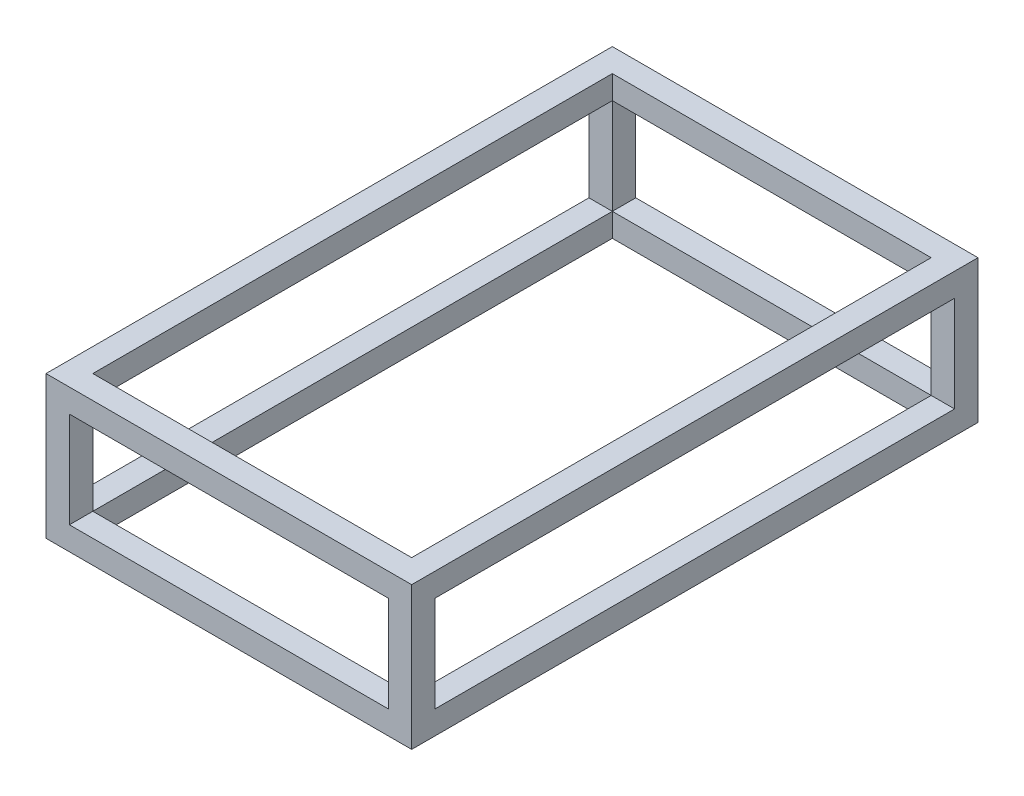
ISO-10303-21;
HEADER;
FILE_DESCRIPTION(('STEP AP214'),'2;1');
FILE_NAME('part.step','',(''),(''),'','','');
FILE_SCHEMA(('AUTOMOTIVE_DESIGN { 1 0 10303 214 1 1 1 1 }'));
ENDSEC;
DATA;
#1=APPLICATION_CONTEXT('core data for automotive mechanical design processes');
#2=APPLICATION_PROTOCOL_DEFINITION('international standard','automotive_design',2000,#1);
#3=PRODUCT_CONTEXT('',#1,'mechanical');
#4=PRODUCT('Part','Part','',(#3));
#5=PRODUCT_RELATED_PRODUCT_CATEGORY('part','',(#4));
#6=PRODUCT_DEFINITION_FORMATION('','',#4);
#7=PRODUCT_DEFINITION_CONTEXT('part definition',#1,'design');
#8=PRODUCT_DEFINITION('design','',#6,#7);
#9=PRODUCT_DEFINITION_SHAPE('','',#8);
#10=(LENGTH_UNIT() NAMED_UNIT(*) SI_UNIT(.MILLI.,.METRE.));
#11=(NAMED_UNIT(*) PLANE_ANGLE_UNIT() SI_UNIT($,.RADIAN.));
#12=(NAMED_UNIT(*) SI_UNIT($,.STERADIAN.) SOLID_ANGLE_UNIT());
#13=UNCERTAINTY_MEASURE_WITH_UNIT(LENGTH_MEASURE(1.E-05),#10,'distance_accuracy_value','');
#14=(GEOMETRIC_REPRESENTATION_CONTEXT(3) GLOBAL_UNCERTAINTY_ASSIGNED_CONTEXT((#13)) GLOBAL_UNIT_ASSIGNED_CONTEXT((#10,
#11,#12)) REPRESENTATION_CONTEXT('',''));
#15=CARTESIAN_POINT('',(0.,0.,0.));
#16=DIRECTION('',(0.,0.,1.));
#17=DIRECTION('',(1.,0.,0.));
#18=AXIS2_PLACEMENT_3D('',#15,#16,#17);
#19=CARTESIAN_POINT('',(706.05,279.8,49.995));
#20=DIRECTION('',(1.,0.,0.));
#21=DIRECTION('',(0.,0.,-1.));
#22=AXIS2_PLACEMENT_3D('',#19,#20,#21);
#23=PLANE('',#22);
#24=DIRECTION('',(0.,-1.,0.));
#25=VECTOR('',#24,1.);
#26=CARTESIAN_POINT('',(706.05,229.8,49.9950000000005));
#27=LINE('',#26,#25);
#28=CARTESIAN_POINT('',(706.05,279.8,49.9950000000005));
#29=VERTEX_POINT('',#28);
#30=CARTESIAN_POINT('',(706.05,229.8,49.995));
#31=VERTEX_POINT('',#30);
#32=EDGE_CURVE('E222',#29,#31,#27,.T.);
#33=ORIENTED_EDGE('',*,*,#32,.T.);
#34=DIRECTION('',(0.,0.,1.));
#35=VECTOR('',#34,1.);
#36=CARTESIAN_POINT('',(706.05,229.8,49.8750000000001));
#37=LINE('',#36,#35);
#38=CARTESIAN_POINT('',(706.05,229.8,1159.675));
#39=VERTEX_POINT('',#38);
#40=EDGE_CURVE('E277',#31,#39,#37,.T.);
#41=ORIENTED_EDGE('',*,*,#40,.T.);
#42=DIRECTION('',(0.,1.,0.));
#43=VECTOR('',#42,1.);
#44=CARTESIAN_POINT('',(706.05,229.8,1159.675));
#45=LINE('',#44,#43);
#46=CARTESIAN_POINT('',(706.05,279.8,1159.675));
#47=VERTEX_POINT('',#46);
#48=EDGE_CURVE('E270',#39,#47,#45,.T.);
#49=ORIENTED_EDGE('',*,*,#48,.T.);
#50=DIRECTION('',(0.,0.,1.));
#51=VECTOR('',#50,1.);
#52=CARTESIAN_POINT('',(706.05,279.8,49.995));
#53=LINE('',#52,#51);
#54=EDGE_CURVE('E59',#29,#47,#53,.T.);
#55=ORIENTED_EDGE('',*,*,#54,.F.);
#56=EDGE_LOOP('',(#33,#41,#49,#55));
#57=FACE_BOUND('',#56,.T.);
#58=ADVANCED_FACE('F43',(#57),#23,.F.);
#59=DIRECTION('',(0.,0.,-1.));
#60=VECTOR('',#59,1.);
#61=CARTESIAN_POINT('',(706.05,229.8,49.9950000000005));
#62=LINE('',#61,#60);
#63=CARTESIAN_POINT('',(706.05,229.8,2.22044604925031E-13));
#64=VERTEX_POINT('',#63);
#65=EDGE_CURVE('E213',#31,#64,#62,.T.);
#66=ORIENTED_EDGE('',*,*,#65,.T.);
#67=DIRECTION('',(0.,-1.,0.));
#68=VECTOR('',#67,1.);
#69=CARTESIAN_POINT('',(706.05,279.8,0.));
#70=LINE('',#69,#68);
#71=CARTESIAN_POINT('',(706.05,25.,0.));
#72=VERTEX_POINT('',#71);
#73=EDGE_CURVE('E196',#64,#72,#70,.T.);
#74=ORIENTED_EDGE('',*,*,#73,.T.);
#75=DIRECTION('',(0.,0.,1.));
#76=VECTOR('',#75,1.);
#77=CARTESIAN_POINT('',(706.05,25.,49.995));
#78=LINE('',#77,#76);
#79=CARTESIAN_POINT('',(706.05,25.,49.995));
#80=VERTEX_POINT('',#79);
#81=EDGE_CURVE('E283',#72,#80,#78,.T.);
#82=ORIENTED_EDGE('',*,*,#81,.T.);
#83=DIRECTION('',(0.,-1.,0.));
#84=VECTOR('',#83,1.);
#85=CARTESIAN_POINT('',(706.05,279.8,49.995));
#86=LINE('',#85,#84);
#87=EDGE_CURVE('E215',#31,#80,#86,.T.);
#88=ORIENTED_EDGE('',*,*,#87,.F.);
#89=EDGE_LOOP('',(#66,#74,#82,#88));
#90=FACE_BOUND('',#89,.T.);
#91=ADVANCED_FACE('F214',(#90),#23,.F.);
#92=CARTESIAN_POINT('',(25.,229.8,49.8750000000001));
#93=DIRECTION('',(-1.,0.,0.));
#94=DIRECTION('',(0.,0.,1.));
#95=AXIS2_PLACEMENT_3D('',#92,#93,#94);
#96=PLANE('',#95);
#97=DIRECTION('',(0.,-1.,0.));
#98=VECTOR('',#97,1.);
#99=CARTESIAN_POINT('',(25.,229.8,49.9950000000005));
#100=LINE('',#99,#98);
#101=CARTESIAN_POINT('',(25.,279.8,49.9950000000005));
#102=VERTEX_POINT('',#101);
#103=CARTESIAN_POINT('',(25.,229.8,49.9950000000005));
#104=VERTEX_POINT('',#103);
#105=EDGE_CURVE('E559',#102,#104,#100,.T.);
#106=ORIENTED_EDGE('',*,*,#105,.F.);
#107=DIRECTION('',(0.,0.,1.));
#108=VECTOR('',#107,1.);
#109=CARTESIAN_POINT('',(25.,279.8,49.8750000000001));
#110=LINE('',#109,#108);
#111=CARTESIAN_POINT('',(25.,279.8,1159.675));
#112=VERTEX_POINT('',#111);
#113=EDGE_CURVE('E261',#102,#112,#110,.T.);
#114=ORIENTED_EDGE('',*,*,#113,.T.);
#115=DIRECTION('',(0.,-1.,0.));
#116=VECTOR('',#115,1.);
#117=CARTESIAN_POINT('',(25.,229.8,1159.675));
#118=LINE('',#117,#116);
#119=CARTESIAN_POINT('',(25.,229.8,1159.675));
#120=VERTEX_POINT('',#119);
#121=EDGE_CURVE('E253',#112,#120,#118,.T.);
#122=ORIENTED_EDGE('',*,*,#121,.T.);
#123=DIRECTION('',(0.,0.,1.));
#124=VECTOR('',#123,1.);
#125=CARTESIAN_POINT('',(25.,229.8,49.8750000000001));
#126=LINE('',#125,#124);
#127=EDGE_CURVE('E267',#104,#120,#126,.T.);
#128=ORIENTED_EDGE('',*,*,#127,.F.);
#129=EDGE_LOOP('',(#106,#114,#122,#128));
#130=FACE_BOUND('',#129,.T.);
#131=ADVANCED_FACE('F567',(#130),#96,.F.);
#132=DIRECTION('',(0.,0.,-1.));
#133=VECTOR('',#132,1.);
#134=CARTESIAN_POINT('',(25.,229.8,49.9950000000005));
#135=LINE('',#134,#133);
#136=CARTESIAN_POINT('',(25.,229.8,2.22044604925031E-13));
#137=VERTEX_POINT('',#136);
#138=EDGE_CURVE('E225',#104,#137,#135,.T.);
#139=ORIENTED_EDGE('',*,*,#138,.F.);
#140=DIRECTION('',(0.,-1.,0.));
#141=VECTOR('',#140,1.);
#142=CARTESIAN_POINT('',(25.,279.8,49.9950000000005));
#143=LINE('',#142,#141);
#144=CARTESIAN_POINT('',(25.,25.,49.9950000000005));
#145=VERTEX_POINT('',#144);
#146=EDGE_CURVE('E245',#104,#145,#143,.T.);
#147=ORIENTED_EDGE('',*,*,#146,.T.);
#148=DIRECTION('',(0.,0.,-1.));
#149=VECTOR('',#148,1.);
#150=CARTESIAN_POINT('',(25.,25.,2.22044604925031E-13));
#151=LINE('',#150,#149);
#152=CARTESIAN_POINT('',(25.,25.,0.));
#153=VERTEX_POINT('',#152);
#154=EDGE_CURVE('E240',#145,#153,#151,.T.);
#155=ORIENTED_EDGE('',*,*,#154,.T.);
#156=DIRECTION('',(0.,-1.,0.));
#157=VECTOR('',#156,1.);
#158=CARTESIAN_POINT('',(25.,279.8,2.22044604925031E-13));
#159=LINE('',#158,#157);
#160=EDGE_CURVE('E67',#137,#153,#159,.T.);
#161=ORIENTED_EDGE('',*,*,#160,.F.);
#162=EDGE_LOOP('',(#139,#147,#155,#161));
#163=FACE_BOUND('',#162,.T.);
#164=ADVANCED_FACE('F523',(#163),#96,.F.);
#165=CARTESIAN_POINT('',(-25.,25.,1209.675));
#166=DIRECTION('',(0.,-1.,0.));
#167=DIRECTION('',(0.,0.,-1.));
#168=AXIS2_PLACEMENT_3D('',#165,#166,#167);
#169=PLANE('',#168);
#170=DIRECTION('',(1.,0.,0.));
#171=VECTOR('',#170,1.);
#172=CARTESIAN_POINT('',(-25.,25.,49.9950000000005));
#173=LINE('',#172,#171);
#174=CARTESIAN_POINT('',(-25.,25.,49.9950000000009));
#175=VERTEX_POINT('',#174);
#176=EDGE_CURVE('E231',#175,#145,#173,.T.);
#177=ORIENTED_EDGE('',*,*,#176,.F.);
#178=DIRECTION('',(0.,0.,-1.));
#179=VECTOR('',#178,1.);
#180=CARTESIAN_POINT('',(-25.,25.,1209.675));
#181=LINE('',#180,#179);
#182=CARTESIAN_POINT('',(-25.,25.,1159.675));
#183=VERTEX_POINT('',#182);
#184=EDGE_CURVE('E468',#183,#175,#181,.T.);
#185=ORIENTED_EDGE('',*,*,#184,.F.);
#186=DIRECTION('',(-1.,0.,0.));
#187=VECTOR('',#186,1.);
#188=CARTESIAN_POINT('',(25.,25.,1159.675));
#189=LINE('',#188,#187);
#190=CARTESIAN_POINT('',(25.,25.,1159.675));
#191=VERTEX_POINT('',#190);
#192=EDGE_CURVE('E347',#191,#183,#189,.T.);
#193=ORIENTED_EDGE('',*,*,#192,.F.);
#194=DIRECTION('',(0.,0.,-1.));
#195=VECTOR('',#194,1.);
#196=CARTESIAN_POINT('',(25.,25.,1209.675));
#197=LINE('',#196,#195);
#198=EDGE_CURVE('E472',#191,#145,#197,.T.);
#199=ORIENTED_EDGE('',*,*,#198,.T.);
#200=EDGE_LOOP('',(#177,#185,#193,#199));
#201=FACE_BOUND('',#200,.T.);
#202=ADVANCED_FACE('F517',(#201),#169,.F.);
#203=ORIENTED_EDGE('',*,*,#154,.F.);
#204=DIRECTION('',(1.,0.,0.));
#205=VECTOR('',#204,1.);
#206=CARTESIAN_POINT('',(25.,25.,49.995));
#207=LINE('',#206,#205);
#208=EDGE_CURVE('E387',#145,#80,#207,.T.);
#209=ORIENTED_EDGE('',*,*,#208,.T.);
#210=ORIENTED_EDGE('',*,*,#81,.F.);
#211=DIRECTION('',(-1.,0.,0.));
#212=VECTOR('',#211,1.);
#213=CARTESIAN_POINT('',(706.05,25.,0.));
#214=LINE('',#213,#212);
#215=CARTESIAN_POINT('',(756.05,25.,0.));
#216=VERTEX_POINT('',#215);
#217=EDGE_CURVE('E203',#216,#72,#214,.T.);
#218=ORIENTED_EDGE('',*,*,#217,.F.);
#219=DIRECTION('',(0.,0.,1.));
#220=VECTOR('',#219,1.);
#221=CARTESIAN_POINT('',(756.05,25.,1209.675));
#222=LINE('',#221,#220);
#223=CARTESIAN_POINT('',(756.05,25.,-0.00500000000003276));
#224=VERTEX_POINT('',#223);
#225=EDGE_CURVE('E428',#224,#216,#222,.T.);
#226=ORIENTED_EDGE('',*,*,#225,.F.);
#227=DIRECTION('',(1.,0.,0.));
#228=VECTOR('',#227,1.);
#229=CARTESIAN_POINT('',(756.05,25.,-0.00500000000003276));
#230=LINE('',#229,#228);
#231=CARTESIAN_POINT('',(25.,25.,-0.00500000000003276));
#232=VERTEX_POINT('',#231);
#233=EDGE_CURVE('E405',#232,#224,#230,.T.);
#234=ORIENTED_EDGE('',*,*,#233,.F.);
#235=DIRECTION('',(0.,0.,-1.));
#236=VECTOR('',#235,1.);
#237=CARTESIAN_POINT('',(25.,25.,-0.00500000000003276));
#238=LINE('',#237,#236);
#239=EDGE_CURVE('E383',#153,#232,#238,.T.);
#240=ORIENTED_EDGE('',*,*,#239,.F.);
#241=EDGE_LOOP('',(#203,#209,#210,#218,#226,#234,#240));
#242=FACE_BOUND('',#241,.T.);
#243=ADVANCED_FACE('F571',(#242),#169,.F.);
#244=CARTESIAN_POINT('',(25.,229.8,49.8750000000001));
#245=DIRECTION('',(0.,1.,0.));
#246=DIRECTION('',(0.,0.,1.));
#247=AXIS2_PLACEMENT_3D('',#244,#245,#246);
#248=PLANE('',#247);
#249=DIRECTION('',(-1.,0.,0.));
#250=VECTOR('',#249,1.);
#251=CARTESIAN_POINT('',(25.,229.8,49.9950000000005));
#252=LINE('',#251,#250);
#253=CARTESIAN_POINT('',(-25.,229.8,49.9950000000005));
#254=VERTEX_POINT('',#253);
#255=EDGE_CURVE('E11',#104,#254,#252,.T.);
#256=ORIENTED_EDGE('',*,*,#255,.F.);
#257=ORIENTED_EDGE('',*,*,#127,.T.);
#258=DIRECTION('',(-1.,0.,0.));
#259=VECTOR('',#258,1.);
#260=CARTESIAN_POINT('',(25.,229.8,1159.675));
#261=LINE('',#260,#259);
#262=CARTESIAN_POINT('',(-25.,229.8,1159.675));
#263=VERTEX_POINT('',#262);
#264=EDGE_CURVE('E257',#120,#263,#261,.T.);
#265=ORIENTED_EDGE('',*,*,#264,.T.);
#266=DIRECTION('',(0.,0.,1.));
#267=VECTOR('',#266,1.);
#268=CARTESIAN_POINT('',(-25.,229.8,49.8750000000001));
#269=LINE('',#268,#267);
#270=EDGE_CURVE('E264',#254,#263,#269,.T.);
#271=ORIENTED_EDGE('',*,*,#270,.F.);
#272=EDGE_LOOP('',(#256,#257,#265,#271));
#273=FACE_BOUND('',#272,.T.);
#274=ADVANCED_FACE('F569',(#273),#248,.F.);
#275=CARTESIAN_POINT('',(25.,279.8,1159.675));
#276=DIRECTION('',(0.,0.,1.));
#277=DIRECTION('',(1.,0.,0.));
#278=AXIS2_PLACEMENT_3D('',#275,#276,#277);
#279=PLANE('',#278);
#280=ORIENTED_EDGE('',*,*,#121,.F.);
#281=DIRECTION('',(-1.,0.,0.));
#282=VECTOR('',#281,1.);
#283=CARTESIAN_POINT('',(25.,279.8,1159.675));
#284=LINE('',#283,#282);
#285=EDGE_CURVE('E342',#47,#112,#284,.T.);
#286=ORIENTED_EDGE('',*,*,#285,.F.);
#287=ORIENTED_EDGE('',*,*,#48,.F.);
#288=DIRECTION('',(-1.,0.,0.));
#289=VECTOR('',#288,1.);
#290=CARTESIAN_POINT('',(756.05,229.8,1159.675));
#291=LINE('',#290,#289);
#292=EDGE_CURVE('E331',#39,#120,#291,.T.);
#293=ORIENTED_EDGE('',*,*,#292,.T.);
#294=EDGE_LOOP('',(#280,#286,#287,#293));
#295=FACE_BOUND('',#294,.T.);
#296=ADVANCED_FACE('F552',(#295),#279,.F.);
#297=ORIENTED_EDGE('',*,*,#264,.F.);
#298=DIRECTION('',(0.,-1.,0.));
#299=VECTOR('',#298,1.);
#300=CARTESIAN_POINT('',(25.,279.8,1159.675));
#301=LINE('',#300,#299);
#302=EDGE_CURVE('E367',#120,#191,#301,.T.);
#303=ORIENTED_EDGE('',*,*,#302,.T.);
#304=ORIENTED_EDGE('',*,*,#192,.T.);
#305=DIRECTION('',(0.,-1.,0.));
#306=VECTOR('',#305,1.);
#307=CARTESIAN_POINT('',(-25.,279.8,1159.675));
#308=LINE('',#307,#306);
#309=EDGE_CURVE('E364',#263,#183,#308,.T.);
#310=ORIENTED_EDGE('',*,*,#309,.F.);
#311=EDGE_LOOP('',(#297,#303,#304,#310));
#312=FACE_BOUND('',#311,.T.);
#313=ADVANCED_FACE('F533',(#312),#279,.F.);
#314=DIRECTION('',(-1.,0.,0.));
#315=VECTOR('',#314,1.);
#316=CARTESIAN_POINT('',(706.05,229.8,1159.675));
#317=LINE('',#316,#315);
#318=CARTESIAN_POINT('',(756.05,229.8,1159.675));
#319=VERTEX_POINT('',#318);
#320=EDGE_CURVE('E273',#319,#39,#317,.T.);
#321=ORIENTED_EDGE('',*,*,#320,.F.);
#322=DIRECTION('',(0.,1.,0.));
#323=VECTOR('',#322,1.);
#324=CARTESIAN_POINT('',(756.05,279.8,1159.675));
#325=LINE('',#324,#323);
#326=CARTESIAN_POINT('',(756.05,25.,1159.675));
#327=VERTEX_POINT('',#326);
#328=EDGE_CURVE('E323',#327,#319,#325,.T.);
#329=ORIENTED_EDGE('',*,*,#328,.F.);
#330=DIRECTION('',(1.,0.,0.));
#331=VECTOR('',#330,1.);
#332=CARTESIAN_POINT('',(756.05,25.,1159.675));
#333=LINE('',#332,#331);
#334=CARTESIAN_POINT('',(706.05,25.,1159.675));
#335=VERTEX_POINT('',#334);
#336=EDGE_CURVE('E308',#335,#327,#333,.T.);
#337=ORIENTED_EDGE('',*,*,#336,.F.);
#338=DIRECTION('',(0.,1.,0.));
#339=VECTOR('',#338,1.);
#340=CARTESIAN_POINT('',(706.05,25.,1159.675));
#341=LINE('',#340,#339);
#342=EDGE_CURVE('E312',#335,#39,#341,.T.);
#343=ORIENTED_EDGE('',*,*,#342,.T.);
#344=EDGE_LOOP('',(#321,#329,#337,#343));
#345=FACE_BOUND('',#344,.T.);
#346=ADVANCED_FACE('F490',(#345),#279,.F.);
#347=CARTESIAN_POINT('',(706.05,279.8,49.995));
#348=DIRECTION('',(0.,0.,-1.));
#349=DIRECTION('',(-1.,0.,0.));
#350=AXIS2_PLACEMENT_3D('',#347,#348,#349);
#351=PLANE('',#350);
#352=DIRECTION('',(1.,0.,0.));
#353=VECTOR('',#352,1.);
#354=CARTESIAN_POINT('',(706.05,229.8,49.995));
#355=LINE('',#354,#353);
#356=CARTESIAN_POINT('',(756.05,229.8,49.995));
#357=VERTEX_POINT('',#356);
#358=EDGE_CURVE('E52',#31,#357,#355,.T.);
#359=ORIENTED_EDGE('',*,*,#358,.F.);
#360=ORIENTED_EDGE('',*,*,#87,.T.);
#361=DIRECTION('',(1.,0.,0.));
#362=VECTOR('',#361,1.);
#363=CARTESIAN_POINT('',(706.05,25.,49.995));
#364=LINE('',#363,#362);
#365=CARTESIAN_POINT('',(756.05,25.,49.995));
#366=VERTEX_POINT('',#365);
#367=EDGE_CURVE('E290',#80,#366,#364,.T.);
#368=ORIENTED_EDGE('',*,*,#367,.T.);
#369=DIRECTION('',(0.,-1.,0.));
#370=VECTOR('',#369,1.);
#371=CARTESIAN_POINT('',(756.05,279.8,49.995));
#372=LINE('',#371,#370);
#373=EDGE_CURVE('E298',#357,#366,#372,.T.);
#374=ORIENTED_EDGE('',*,*,#373,.F.);
#375=EDGE_LOOP('',(#359,#360,#368,#374));
#376=FACE_BOUND('',#375,.T.);
#377=ADVANCED_FACE('F587',(#376),#351,.F.);
#378=ORIENTED_EDGE('',*,*,#367,.F.);
#379=DIRECTION('',(0.,0.,1.));
#380=VECTOR('',#379,1.);
#381=CARTESIAN_POINT('',(706.05,25.,-0.00500000000003276));
#382=LINE('',#381,#380);
#383=EDGE_CURVE('E409',#80,#335,#382,.T.);
#384=ORIENTED_EDGE('',*,*,#383,.T.);
#385=ORIENTED_EDGE('',*,*,#336,.T.);
#386=EDGE_CURVE('E427',#366,#327,#222,.T.);
#387=ORIENTED_EDGE('',*,*,#386,.F.);
#388=EDGE_LOOP('',(#378,#384,#385,#387));
#389=FACE_BOUND('',#388,.T.);
#390=ADVANCED_FACE('F493',(#389),#169,.F.);
#391=DIRECTION('',(0.,0.,-1.));
#392=VECTOR('',#391,1.);
#393=CARTESIAN_POINT('',(706.05,25.,1209.675));
#394=LINE('',#393,#392);
#395=CARTESIAN_POINT('',(706.05,25.,1209.675));
#396=VERTEX_POINT('',#395);
#397=EDGE_CURVE('E304',#396,#335,#394,.T.);
#398=ORIENTED_EDGE('',*,*,#397,.T.);
#399=DIRECTION('',(-1.,0.,0.));
#400=VECTOR('',#399,1.);
#401=CARTESIAN_POINT('',(756.05,25.,1159.675));
#402=LINE('',#401,#400);
#403=EDGE_CURVE('E432',#335,#191,#402,.T.);
#404=ORIENTED_EDGE('',*,*,#403,.T.);
#405=DIRECTION('',(0.,0.,-1.));
#406=VECTOR('',#405,1.);
#407=CARTESIAN_POINT('',(25.,25.,1159.675));
#408=LINE('',#407,#406);
#409=CARTESIAN_POINT('',(25.,25.,1209.675));
#410=VERTEX_POINT('',#409);
#411=EDGE_CURVE('E341',#410,#191,#408,.T.);
#412=ORIENTED_EDGE('',*,*,#411,.F.);
#413=DIRECTION('',(-1.,0.,0.));
#414=VECTOR('',#413,1.);
#415=CARTESIAN_POINT('',(-25.,25.,1209.675));
#416=LINE('',#415,#414);
#417=EDGE_CURVE('E443',#396,#410,#416,.T.);
#418=ORIENTED_EDGE('',*,*,#417,.F.);
#419=EDGE_LOOP('',(#398,#404,#412,#418));
#420=FACE_BOUND('',#419,.T.);
#421=ADVANCED_FACE('F508',(#420),#169,.F.);
#422=CARTESIAN_POINT('',(756.05,229.8,1209.675));
#423=DIRECTION('',(0.,1.,0.));
#424=DIRECTION('',(0.,0.,1.));
#425=AXIS2_PLACEMENT_3D('',#422,#423,#424);
#426=PLANE('',#425);
#427=DIRECTION('',(0.,0.,-1.));
#428=VECTOR('',#427,1.);
#429=CARTESIAN_POINT('',(706.05,229.8,1209.675));
#430=LINE('',#429,#428);
#431=CARTESIAN_POINT('',(706.05,229.8,1209.675));
#432=VERTEX_POINT('',#431);
#433=EDGE_CURVE('E303',#432,#39,#430,.T.);
#434=ORIENTED_EDGE('',*,*,#433,.F.);
#435=DIRECTION('',(-1.,0.,0.));
#436=VECTOR('',#435,1.);
#437=CARTESIAN_POINT('',(756.05,229.8,1209.675));
#438=LINE('',#437,#436);
#439=CARTESIAN_POINT('',(25.,229.8,1209.675));
#440=VERTEX_POINT('',#439);
#441=EDGE_CURVE('E338',#432,#440,#438,.T.);
#442=ORIENTED_EDGE('',*,*,#441,.T.);
#443=DIRECTION('',(0.,0.,-1.));
#444=VECTOR('',#443,1.);
#445=CARTESIAN_POINT('',(25.,229.8,1209.675));
#446=LINE('',#445,#444);
#447=EDGE_CURVE('E322',#440,#120,#446,.T.);
#448=ORIENTED_EDGE('',*,*,#447,.T.);
#449=ORIENTED_EDGE('',*,*,#292,.F.);
#450=EDGE_LOOP('',(#434,#442,#448,#449));
#451=FACE_BOUND('',#450,.T.);
#452=ADVANCED_FACE('F548',(#451),#426,.F.);
#453=CARTESIAN_POINT('',(25.,279.8,1159.675));
#454=DIRECTION('',(-1.,0.,0.));
#455=DIRECTION('',(0.,0.,1.));
#456=AXIS2_PLACEMENT_3D('',#453,#454,#455);
#457=PLANE('',#456);
#458=ORIENTED_EDGE('',*,*,#447,.F.);
#459=DIRECTION('',(0.,-1.,0.));
#460=VECTOR('',#459,1.);
#461=CARTESIAN_POINT('',(25.,279.8,1209.675));
#462=LINE('',#461,#460);
#463=EDGE_CURVE('E354',#440,#410,#462,.T.);
#464=ORIENTED_EDGE('',*,*,#463,.T.);
#465=ORIENTED_EDGE('',*,*,#411,.T.);
#466=ORIENTED_EDGE('',*,*,#302,.F.);
#467=EDGE_LOOP('',(#458,#464,#465,#466));
#468=FACE_BOUND('',#467,.T.);
#469=ADVANCED_FACE('F537',(#468),#457,.F.);
#470=CARTESIAN_POINT('',(25.,-25.,1209.675));
#471=DIRECTION('',(-1.,0.,0.));
#472=DIRECTION('',(0.,0.,1.));
#473=AXIS2_PLACEMENT_3D('',#470,#471,#472);
#474=PLANE('',#473);
#475=DIRECTION('',(0.,1.,0.));
#476=VECTOR('',#475,1.);
#477=CARTESIAN_POINT('',(25.,25.,49.995));
#478=LINE('',#477,#476);
#479=CARTESIAN_POINT('',(25.,-25.,49.9950000000005));
#480=VERTEX_POINT('',#479);
#481=EDGE_CURVE('E379',#480,#145,#478,.T.);
#482=ORIENTED_EDGE('',*,*,#481,.T.);
#483=ORIENTED_EDGE('',*,*,#198,.F.);
#484=DIRECTION('',(0.,1.,0.));
#485=VECTOR('',#484,1.);
#486=CARTESIAN_POINT('',(25.,25.,1159.675));
#487=LINE('',#486,#485);
#488=CARTESIAN_POINT('',(25.,-25.,1159.675));
#489=VERTEX_POINT('',#488);
#490=EDGE_CURVE('E419',#489,#191,#487,.T.);
#491=ORIENTED_EDGE('',*,*,#490,.F.);
#492=DIRECTION('',(0.,0.,-1.));
#493=VECTOR('',#492,1.);
#494=CARTESIAN_POINT('',(25.,-25.,1209.675));
#495=LINE('',#494,#493);
#496=EDGE_CURVE('E453',#489,#480,#495,.T.);
#497=ORIENTED_EDGE('',*,*,#496,.T.);
#498=EDGE_LOOP('',(#482,#483,#491,#497));
#499=FACE_BOUND('',#498,.T.);
#500=ADVANCED_FACE('F45',(#499),#474,.F.);
#501=CARTESIAN_POINT('',(706.05,25.,-0.00500000000003276));
#502=DIRECTION('',(1.,0.,0.));
#503=DIRECTION('',(0.,0.,-1.));
#504=AXIS2_PLACEMENT_3D('',#501,#502,#503);
#505=PLANE('',#504);
#506=DIRECTION('',(0.,1.,0.));
#507=VECTOR('',#506,1.);
#508=CARTESIAN_POINT('',(706.05,25.,49.995));
#509=LINE('',#508,#507);
#510=CARTESIAN_POINT('',(706.05,-25.,49.995));
#511=VERTEX_POINT('',#510);
#512=EDGE_CURVE('E370',#511,#80,#509,.T.);
#513=ORIENTED_EDGE('',*,*,#512,.F.);
#514=DIRECTION('',(0.,0.,1.));
#515=VECTOR('',#514,1.);
#516=CARTESIAN_POINT('',(706.05,-25.,-0.00500000000003276));
#517=LINE('',#516,#515);
#518=CARTESIAN_POINT('',(706.05,-25.,1159.675));
#519=VERTEX_POINT('',#518);
#520=EDGE_CURVE('E416',#511,#519,#517,.T.);
#521=ORIENTED_EDGE('',*,*,#520,.T.);
#522=DIRECTION('',(0.,1.,0.));
#523=VECTOR('',#522,1.);
#524=CARTESIAN_POINT('',(706.05,25.,1159.675));
#525=LINE('',#524,#523);
#526=EDGE_CURVE('E397',#519,#335,#525,.T.);
#527=ORIENTED_EDGE('',*,*,#526,.T.);
#528=ORIENTED_EDGE('',*,*,#383,.F.);
#529=EDGE_LOOP('',(#513,#521,#527,#528));
#530=FACE_BOUND('',#529,.T.);
#531=ADVANCED_FACE('F499',(#530),#505,.F.);
#532=CARTESIAN_POINT('',(756.05,25.,1159.675));
#533=DIRECTION('',(0.,0.,1.));
#534=DIRECTION('',(1.,0.,0.));
#535=AXIS2_PLACEMENT_3D('',#532,#533,#534);
#536=PLANE('',#535);
#537=ORIENTED_EDGE('',*,*,#526,.F.);
#538=DIRECTION('',(-1.,0.,0.));
#539=VECTOR('',#538,1.);
#540=CARTESIAN_POINT('',(756.05,-25.,1159.675));
#541=LINE('',#540,#539);
#542=EDGE_CURVE('E439',#519,#489,#541,.T.);
#543=ORIENTED_EDGE('',*,*,#542,.T.);
#544=ORIENTED_EDGE('',*,*,#490,.T.);
#545=ORIENTED_EDGE('',*,*,#403,.F.);
#546=EDGE_LOOP('',(#537,#543,#544,#545));
#547=FACE_BOUND('',#546,.T.);
#548=ADVANCED_FACE('F503',(#547),#536,.F.);
#549=CARTESIAN_POINT('',(-25.,-25.,1209.675));
#550=DIRECTION('',(1.,0.,0.));
#551=DIRECTION('',(0.,0.,-1.));
#552=AXIS2_PLACEMENT_3D('',#549,#550,#551);
#553=PLANE('',#552);
#554=DIRECTION('',(0.,-1.,0.));
#555=VECTOR('',#554,1.);
#556=CARTESIAN_POINT('',(-25.,-25.,1209.675));
#557=LINE('',#556,#555);
#558=CARTESIAN_POINT('',(-25.,279.8,1209.675));
#559=VERTEX_POINT('',#558);
#560=CARTESIAN_POINT('',(-25.,-25.,1209.675));
#561=VERTEX_POINT('',#560);
#562=EDGE_CURVE('E446',#559,#561,#557,.T.);
#563=ORIENTED_EDGE('',*,*,#562,.F.);
#564=DIRECTION('',(0.,0.,1.));
#565=VECTOR('',#564,1.);
#566=CARTESIAN_POINT('',(-25.,279.8,1159.675));
#567=LINE('',#566,#565);
#568=CARTESIAN_POINT('',(-25.,279.8,2.22044604925031E-13));
#569=VERTEX_POINT('',#568);
#570=EDGE_CURVE('E346',#569,#559,#567,.T.);
#571=ORIENTED_EDGE('',*,*,#570,.F.);
#572=DIRECTION('',(0.,-1.,0.));
#573=VECTOR('',#572,1.);
#574=CARTESIAN_POINT('',(-25.,-25.,0.));
#575=LINE('',#574,#573);
#576=CARTESIAN_POINT('',(-25.,-25.,0.));
#577=VERTEX_POINT('',#576);
#578=EDGE_CURVE('E457',#569,#577,#575,.T.);
#579=ORIENTED_EDGE('',*,*,#578,.T.);
#580=DIRECTION('',(0.,0.,-1.));
#581=VECTOR('',#580,1.);
#582=CARTESIAN_POINT('',(-25.,-25.,1209.675));
#583=LINE('',#582,#581);
#584=EDGE_CURVE('E464',#561,#577,#583,.T.);
#585=ORIENTED_EDGE('',*,*,#584,.F.);
#586=EDGE_LOOP('',(#563,#571,#579,#585));
#587=FACE_BOUND('',#586,.T.);
#588=DIRECTION('',(0.,-1.,0.));
#589=VECTOR('',#588,1.);
#590=CARTESIAN_POINT('',(-25.,279.8,49.9950000000005));
#591=LINE('',#590,#589);
#592=EDGE_CURVE('E249',#254,#175,#591,.T.);
#593=ORIENTED_EDGE('',*,*,#592,.F.);
#594=ORIENTED_EDGE('',*,*,#270,.T.);
#595=ORIENTED_EDGE('',*,*,#309,.T.);
#596=ORIENTED_EDGE('',*,*,#184,.T.);
#597=EDGE_LOOP('',(#593,#594,#595,#596));
#598=FACE_BOUND('',#597,.T.);
#599=ADVANCED_FACE('F529',(#587,#598),#553,.F.);
#600=CARTESIAN_POINT('',(-25.,-25.,1209.675));
#601=DIRECTION('',(0.,1.,0.));
#602=DIRECTION('',(0.,0.,1.));
#603=AXIS2_PLACEMENT_3D('',#600,#601,#602);
#604=PLANE('',#603);
#605=DIRECTION('',(1.,0.,0.));
#606=VECTOR('',#605,1.);
#607=CARTESIAN_POINT('',(25.,-25.,49.995));
#608=LINE('',#607,#606);
#609=EDGE_CURVE('E394',#480,#511,#608,.T.);
#610=ORIENTED_EDGE('',*,*,#609,.F.);
#611=ORIENTED_EDGE('',*,*,#496,.F.);
#612=ORIENTED_EDGE('',*,*,#542,.F.);
#613=ORIENTED_EDGE('',*,*,#520,.F.);
#614=EDGE_LOOP('',(#610,#611,#612,#613));
#615=FACE_BOUND('',#614,.T.);
#616=DIRECTION('',(1.,0.,0.));
#617=VECTOR('',#616,1.);
#618=CARTESIAN_POINT('',(-25.,-25.,0.));
#619=LINE('',#618,#617);
#620=CARTESIAN_POINT('',(25.,-25.,0.));
#621=VERTEX_POINT('',#620);
#622=EDGE_CURVE('E447',#577,#621,#619,.T.);
#623=ORIENTED_EDGE('',*,*,#622,.T.);
#624=DIRECTION('',(0.,0.,1.));
#625=VECTOR('',#624,1.);
#626=CARTESIAN_POINT('',(25.,-25.,-0.00500000000003276));
#627=LINE('',#626,#625);
#628=CARTESIAN_POINT('',(25.,-25.,-0.00500000000003276));
#629=VERTEX_POINT('',#628);
#630=EDGE_CURVE('E375',#629,#621,#627,.T.);
#631=ORIENTED_EDGE('',*,*,#630,.F.);
#632=DIRECTION('',(-1.,0.,0.));
#633=VECTOR('',#632,1.);
#634=CARTESIAN_POINT('',(756.05,-25.,-0.00500000000003276));
#635=LINE('',#634,#633);
#636=CARTESIAN_POINT('',(756.05,-25.,-0.00500000000003276));
#637=VERTEX_POINT('',#636);
#638=EDGE_CURVE('E402',#637,#629,#635,.T.);
#639=ORIENTED_EDGE('',*,*,#638,.F.);
#640=DIRECTION('',(0.,0.,-1.));
#641=VECTOR('',#640,1.);
#642=CARTESIAN_POINT('',(756.05,-25.,1209.675));
#643=LINE('',#642,#641);
#644=CARTESIAN_POINT('',(756.05,-25.,1209.675));
#645=VERTEX_POINT('',#644);
#646=EDGE_CURVE('E424',#645,#637,#643,.T.);
#647=ORIENTED_EDGE('',*,*,#646,.F.);
#648=DIRECTION('',(1.,0.,0.));
#649=VECTOR('',#648,1.);
#650=CARTESIAN_POINT('',(-25.,-25.,1209.675));
#651=LINE('',#650,#649);
#652=EDGE_CURVE('E450',#561,#645,#651,.T.);
#653=ORIENTED_EDGE('',*,*,#652,.F.);
#654=ORIENTED_EDGE('',*,*,#584,.T.);
#655=EDGE_LOOP('',(#623,#631,#639,#647,#653,#654));
#656=FACE_BOUND('',#655,.T.);
#657=ADVANCED_FACE('F617',(#615,#656),#604,.F.);
#658=CARTESIAN_POINT('',(0.,0.,1209.675));
#659=DIRECTION('',(0.,0.,-1.));
#660=DIRECTION('',(-1.,0.,0.));
#661=AXIS2_PLACEMENT_3D('',#658,#659,#660);
#662=PLANE('',#661);
#663=DIRECTION('',(0.,1.,0.));
#664=VECTOR('',#663,1.);
#665=CARTESIAN_POINT('',(706.05,25.,1209.675));
#666=LINE('',#665,#664);
#667=EDGE_CURVE('E319',#396,#432,#666,.T.);
#668=ORIENTED_EDGE('',*,*,#667,.F.);
#669=ORIENTED_EDGE('',*,*,#417,.T.);
#670=ORIENTED_EDGE('',*,*,#463,.F.);
#671=ORIENTED_EDGE('',*,*,#441,.F.);
#672=EDGE_LOOP('',(#668,#669,#670,#671));
#673=FACE_BOUND('',#672,.T.);
#674=ORIENTED_EDGE('',*,*,#652,.T.);
#675=DIRECTION('',(0.,-1.,0.));
#676=VECTOR('',#675,1.);
#677=CARTESIAN_POINT('',(756.05,25.,1209.675));
#678=LINE('',#677,#676);
#679=CARTESIAN_POINT('',(756.05,279.8,1209.675));
#680=VERTEX_POINT('',#679);
#681=EDGE_CURVE('E420',#680,#645,#678,.T.);
#682=ORIENTED_EDGE('',*,*,#681,.F.);
#683=DIRECTION('',(1.,0.,0.));
#684=VECTOR('',#683,1.);
#685=CARTESIAN_POINT('',(25.,279.8,1209.675));
#686=LINE('',#685,#684);
#687=EDGE_CURVE('E350',#559,#680,#686,.T.);
#688=ORIENTED_EDGE('',*,*,#687,.F.);
#689=ORIENTED_EDGE('',*,*,#562,.T.);
#690=EDGE_LOOP('',(#674,#682,#688,#689));
#691=FACE_BOUND('',#690,.T.);
#692=ADVANCED_FACE('F541',(#673,#691),#662,.F.);
#693=CARTESIAN_POINT('',(0.,0.,0.));
#694=DIRECTION('',(0.,0.,-1.));
#695=DIRECTION('',(-1.,0.,0.));
#696=AXIS2_PLACEMENT_3D('',#693,#694,#695);
#697=PLANE('',#696);
#698=DIRECTION('',(0.,1.,0.));
#699=VECTOR('',#698,1.);
#700=CARTESIAN_POINT('',(25.,-25.,0.));
#701=LINE('',#700,#699);
#702=EDGE_CURVE('E442',#621,#153,#701,.T.);
#703=ORIENTED_EDGE('',*,*,#702,.F.);
#704=ORIENTED_EDGE('',*,*,#622,.F.);
#705=ORIENTED_EDGE('',*,*,#578,.F.);
#706=DIRECTION('',(-1.,0.,0.));
#707=VECTOR('',#706,1.);
#708=CARTESIAN_POINT('',(706.05,279.8,0.));
#709=LINE('',#708,#707);
#710=CARTESIAN_POINT('',(756.05,279.8,0.));
#711=VERTEX_POINT('',#710);
#712=EDGE_CURVE('E209',#711,#569,#709,.T.);
#713=ORIENTED_EDGE('',*,*,#712,.F.);
#714=DIRECTION('',(0.,-1.,0.));
#715=VECTOR('',#714,1.);
#716=CARTESIAN_POINT('',(756.05,279.8,0.));
#717=LINE('',#716,#715);
#718=EDGE_CURVE('E208',#711,#216,#717,.T.);
#719=ORIENTED_EDGE('',*,*,#718,.T.);
#720=ORIENTED_EDGE('',*,*,#217,.T.);
#721=ORIENTED_EDGE('',*,*,#73,.F.);
#722=DIRECTION('',(-1.,0.,0.));
#723=VECTOR('',#722,1.);
#724=CARTESIAN_POINT('',(706.05,229.8,2.22044604925031E-13));
#725=LINE('',#724,#723);
#726=EDGE_CURVE('E201',#64,#137,#725,.T.);
#727=ORIENTED_EDGE('',*,*,#726,.T.);
#728=ORIENTED_EDGE('',*,*,#160,.T.);
#729=EDGE_LOOP('',(#703,#704,#705,#713,#719,#720,#721,#727,#728));
#730=FACE_BOUND('',#729,.T.);
#731=ADVANCED_FACE('F199',(#730),#697,.T.);
#732=CARTESIAN_POINT('',(756.05,0.,0.));
#733=DIRECTION('',(1.,0.,0.));
#734=DIRECTION('',(0.,0.,-1.));
#735=AXIS2_PLACEMENT_3D('',#732,#733,#734);
#736=PLANE('',#735);
#737=DIRECTION('',(0.,0.,1.));
#738=VECTOR('',#737,1.);
#739=CARTESIAN_POINT('',(756.05,229.8,49.8750000000001));
#740=LINE('',#739,#738);
#741=EDGE_CURVE('E280',#357,#319,#740,.T.);
#742=ORIENTED_EDGE('',*,*,#741,.F.);
#743=ORIENTED_EDGE('',*,*,#373,.T.);
#744=ORIENTED_EDGE('',*,*,#386,.T.);
#745=ORIENTED_EDGE('',*,*,#328,.T.);
#746=EDGE_LOOP('',(#742,#743,#744,#745));
#747=FACE_BOUND('',#746,.T.);
#748=ORIENTED_EDGE('',*,*,#718,.F.);
#749=DIRECTION('',(0.,0.,1.));
#750=VECTOR('',#749,1.);
#751=CARTESIAN_POINT('',(756.05,279.8,1209.675));
#752=LINE('',#751,#750);
#753=EDGE_CURVE('E327',#711,#680,#752,.T.);
#754=ORIENTED_EDGE('',*,*,#753,.T.);
#755=ORIENTED_EDGE('',*,*,#681,.T.);
#756=ORIENTED_EDGE('',*,*,#646,.T.);
#757=DIRECTION('',(0.,-1.,0.));
#758=VECTOR('',#757,1.);
#759=CARTESIAN_POINT('',(756.05,25.,-0.00500000000003276));
#760=LINE('',#759,#758);
#761=EDGE_CURVE('E398',#224,#637,#760,.T.);
#762=ORIENTED_EDGE('',*,*,#761,.F.);
#763=ORIENTED_EDGE('',*,*,#225,.T.);
#764=EDGE_LOOP('',(#748,#754,#755,#756,#762,#763));
#765=FACE_BOUND('',#764,.T.);
#766=ADVANCED_FACE('F484',(#747,#765),#736,.T.);
#767=CARTESIAN_POINT('',(0.,0.,-0.00500000000003276));
#768=DIRECTION('',(0.,0.,-1.));
#769=DIRECTION('',(-1.,0.,0.));
#770=AXIS2_PLACEMENT_3D('',#767,#768,#769);
#771=PLANE('',#770);
#772=ORIENTED_EDGE('',*,*,#761,.T.);
#773=ORIENTED_EDGE('',*,*,#638,.T.);
#774=DIRECTION('',(0.,-1.,0.));
#775=VECTOR('',#774,1.);
#776=CARTESIAN_POINT('',(25.,25.,-0.00500000000003276));
#777=LINE('',#776,#775);
#778=EDGE_CURVE('E371',#232,#629,#777,.T.);
#779=ORIENTED_EDGE('',*,*,#778,.F.);
#780=ORIENTED_EDGE('',*,*,#233,.T.);
#781=EDGE_LOOP('',(#772,#773,#779,#780));
#782=FACE_BOUND('',#781,.T.);
#783=ADVANCED_FACE('F605',(#782),#771,.T.);
#784=CARTESIAN_POINT('',(25.,25.,49.995));
#785=DIRECTION('',(0.,0.,-1.));
#786=DIRECTION('',(-1.,0.,0.));
#787=AXIS2_PLACEMENT_3D('',#784,#785,#786);
#788=PLANE('',#787);
#789=ORIENTED_EDGE('',*,*,#512,.T.);
#790=ORIENTED_EDGE('',*,*,#208,.F.);
#791=ORIENTED_EDGE('',*,*,#481,.F.);
#792=ORIENTED_EDGE('',*,*,#609,.T.);
#793=EDGE_LOOP('',(#789,#790,#791,#792));
#794=FACE_BOUND('',#793,.T.);
#795=ADVANCED_FACE('F520',(#794),#788,.F.);
#796=CARTESIAN_POINT('',(25.,0.,0.));
#797=DIRECTION('',(-1.,0.,0.));
#798=DIRECTION('',(0.,0.,1.));
#799=AXIS2_PLACEMENT_3D('',#796,#797,#798);
#800=PLANE('',#799);
#801=ORIENTED_EDGE('',*,*,#630,.T.);
#802=ORIENTED_EDGE('',*,*,#702,.T.);
#803=ORIENTED_EDGE('',*,*,#239,.T.);
#804=ORIENTED_EDGE('',*,*,#778,.T.);
#805=EDGE_LOOP('',(#801,#802,#803,#804));
#806=FACE_BOUND('',#805,.T.);
#807=ADVANCED_FACE('F595',(#806),#800,.T.);
#808=CARTESIAN_POINT('',(0.,279.8,0.));
#809=DIRECTION('',(0.,-1.,0.));
#810=DIRECTION('',(0.,0.,-1.));
#811=AXIS2_PLACEMENT_3D('',#808,#809,#810);
#812=PLANE('',#811);
#813=DIRECTION('',(-1.,0.,0.));
#814=VECTOR('',#813,1.);
#815=CARTESIAN_POINT('',(706.05,279.8,49.9950000000005));
#816=LINE('',#815,#814);
#817=EDGE_CURVE('E221',#29,#102,#816,.T.);
#818=ORIENTED_EDGE('',*,*,#817,.F.);
#819=ORIENTED_EDGE('',*,*,#54,.T.);
#820=ORIENTED_EDGE('',*,*,#285,.T.);
#821=ORIENTED_EDGE('',*,*,#113,.F.);
#822=EDGE_LOOP('',(#818,#819,#820,#821));
#823=FACE_BOUND('',#822,.T.);
#824=ORIENTED_EDGE('',*,*,#570,.T.);
#825=ORIENTED_EDGE('',*,*,#687,.T.);
#826=ORIENTED_EDGE('',*,*,#753,.F.);
#827=ORIENTED_EDGE('',*,*,#712,.T.);
#828=EDGE_LOOP('',(#824,#825,#826,#827));
#829=FACE_BOUND('',#828,.T.);
#830=ADVANCED_FACE('F591',(#823,#829),#812,.F.);
#831=CARTESIAN_POINT('',(706.05,25.,1209.675));
#832=DIRECTION('',(1.,0.,0.));
#833=DIRECTION('',(0.,0.,-1.));
#834=AXIS2_PLACEMENT_3D('',#831,#832,#833);
#835=PLANE('',#834);
#836=ORIENTED_EDGE('',*,*,#433,.T.);
#837=ORIENTED_EDGE('',*,*,#342,.F.);
#838=ORIENTED_EDGE('',*,*,#397,.F.);
#839=ORIENTED_EDGE('',*,*,#667,.T.);
#840=EDGE_LOOP('',(#836,#837,#838,#839));
#841=FACE_BOUND('',#840,.T.);
#842=ADVANCED_FACE('F545',(#841),#835,.F.);
#843=CARTESIAN_POINT('',(706.05,229.8,49.8750000000001));
#844=DIRECTION('',(0.,1.,0.));
#845=DIRECTION('',(0.,0.,1.));
#846=AXIS2_PLACEMENT_3D('',#843,#844,#845);
#847=PLANE('',#846);
#848=ORIENTED_EDGE('',*,*,#40,.F.);
#849=ORIENTED_EDGE('',*,*,#358,.T.);
#850=ORIENTED_EDGE('',*,*,#741,.T.);
#851=ORIENTED_EDGE('',*,*,#320,.T.);
#852=EDGE_LOOP('',(#848,#849,#850,#851));
#853=FACE_BOUND('',#852,.T.);
#854=ADVANCED_FACE('F480',(#853),#847,.F.);
#855=CARTESIAN_POINT('',(-25.,279.8,49.9950000000005));
#856=DIRECTION('',(0.,0.,-1.));
#857=DIRECTION('',(-1.,0.,0.));
#858=AXIS2_PLACEMENT_3D('',#855,#856,#857);
#859=PLANE('',#858);
#860=ORIENTED_EDGE('',*,*,#146,.F.);
#861=ORIENTED_EDGE('',*,*,#255,.T.);
#862=ORIENTED_EDGE('',*,*,#592,.T.);
#863=ORIENTED_EDGE('',*,*,#176,.T.);
#864=EDGE_LOOP('',(#860,#861,#862,#863));
#865=FACE_BOUND('',#864,.T.);
#866=ADVANCED_FACE('F526',(#865),#859,.F.);
#867=CARTESIAN_POINT('',(706.05,229.8,49.9950000000005));
#868=DIRECTION('',(0.,0.,-1.));
#869=DIRECTION('',(-1.,0.,0.));
#870=AXIS2_PLACEMENT_3D('',#867,#868,#869);
#871=PLANE('',#870);
#872=ORIENTED_EDGE('',*,*,#105,.T.);
#873=DIRECTION('',(-1.,0.,0.));
#874=VECTOR('',#873,1.);
#875=CARTESIAN_POINT('',(706.05,229.8,49.9950000000005));
#876=LINE('',#875,#874);
#877=EDGE_CURVE('E227',#31,#104,#876,.T.);
#878=ORIENTED_EDGE('',*,*,#877,.F.);
#879=ORIENTED_EDGE('',*,*,#32,.F.);
#880=ORIENTED_EDGE('',*,*,#817,.T.);
#881=EDGE_LOOP('',(#872,#878,#879,#880));
#882=FACE_BOUND('',#881,.T.);
#883=ADVANCED_FACE('F564',(#882),#871,.F.);
#884=CARTESIAN_POINT('',(706.05,229.8,49.9950000000005));
#885=DIRECTION('',(0.,1.,0.));
#886=DIRECTION('',(0.,0.,1.));
#887=AXIS2_PLACEMENT_3D('',#884,#885,#886);
#888=PLANE('',#887);
#889=ORIENTED_EDGE('',*,*,#138,.T.);
#890=ORIENTED_EDGE('',*,*,#726,.F.);
#891=ORIENTED_EDGE('',*,*,#65,.F.);
#892=ORIENTED_EDGE('',*,*,#877,.T.);
#893=EDGE_LOOP('',(#889,#890,#891,#892));
#894=FACE_BOUND('',#893,.T.);
#895=ADVANCED_FACE('F224',(#894),#888,.F.);
#896=CLOSED_SHELL('',(#58,#91,#131,#164,#202,#243,#274,#296,#313,#346,#377,#390,#421,#452,#469,
#500,#531,#548,#599,#657,#692,#731,#766,#783,#795,#807,#830,#842,#854,#866,#883,#895));
#897=MANIFOLD_SOLID_BREP('B2',#896);
#898=ADVANCED_BREP_SHAPE_REPRESENTATION('',(#18,#897),#14);
#899=SHAPE_DEFINITION_REPRESENTATION(#9,#898);
ENDSEC;
END-ISO-10303-21;
